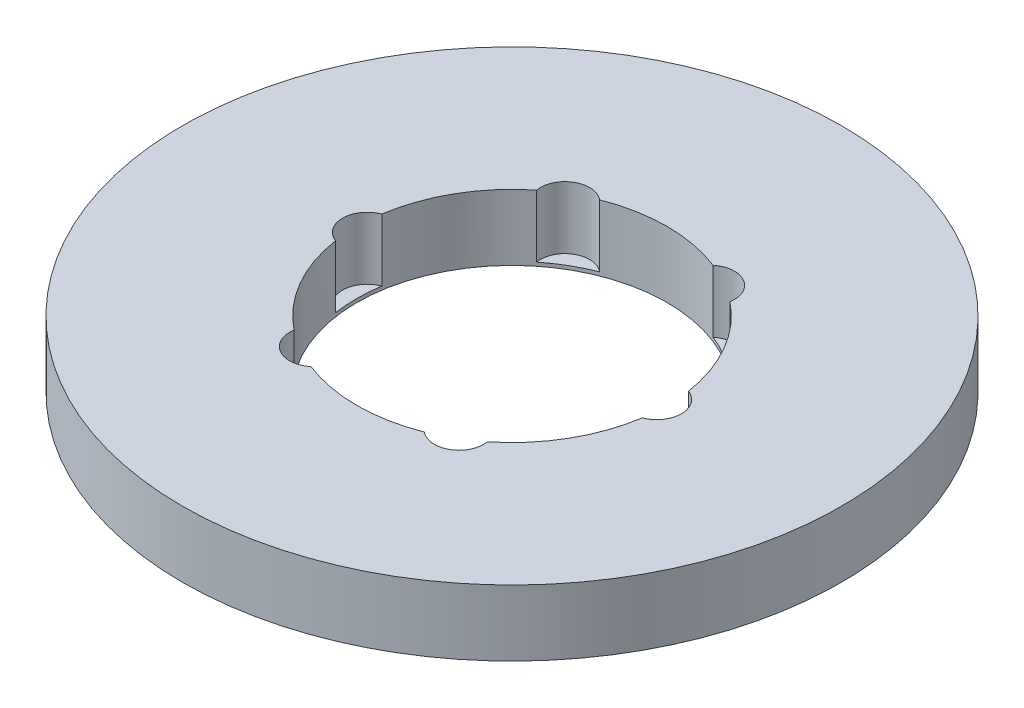
ISO-10303-21;
HEADER;
FILE_DESCRIPTION(('STEP AP214'),'2;1');
FILE_NAME('part.step','',(''),(''),'','','');
FILE_SCHEMA(('AUTOMOTIVE_DESIGN { 1 0 10303 214 1 1 1 1 }'));
ENDSEC;
DATA;
#1=APPLICATION_CONTEXT('core data for automotive mechanical design processes');
#2=APPLICATION_PROTOCOL_DEFINITION('international standard','automotive_design',2000,#1);
#3=PRODUCT_CONTEXT('',#1,'mechanical');
#4=PRODUCT('Part','Part','',(#3));
#5=PRODUCT_RELATED_PRODUCT_CATEGORY('part','',(#4));
#6=PRODUCT_DEFINITION_FORMATION('','',#4);
#7=PRODUCT_DEFINITION_CONTEXT('part definition',#1,'design');
#8=PRODUCT_DEFINITION('design','',#6,#7);
#9=PRODUCT_DEFINITION_SHAPE('','',#8);
#10=(LENGTH_UNIT() NAMED_UNIT(*) SI_UNIT(.MILLI.,.METRE.));
#11=(NAMED_UNIT(*) PLANE_ANGLE_UNIT() SI_UNIT($,.RADIAN.));
#12=(NAMED_UNIT(*) SI_UNIT($,.STERADIAN.) SOLID_ANGLE_UNIT());
#13=UNCERTAINTY_MEASURE_WITH_UNIT(LENGTH_MEASURE(1.E-05),#10,'distance_accuracy_value','');
#14=(GEOMETRIC_REPRESENTATION_CONTEXT(3) GLOBAL_UNCERTAINTY_ASSIGNED_CONTEXT((#13)) GLOBAL_UNIT_ASSIGNED_CONTEXT((#10,
#11,#12)) REPRESENTATION_CONTEXT('',''));
#15=CARTESIAN_POINT('',(0.,0.,0.));
#16=DIRECTION('',(0.,0.,1.));
#17=DIRECTION('',(1.,0.,0.));
#18=AXIS2_PLACEMENT_3D('',#15,#16,#17);
#19=CARTESIAN_POINT('',(0.,17.,0.));
#20=DIRECTION('',(0.,-1.,0.));
#21=DIRECTION('',(0.,0.,-1.));
#22=AXIS2_PLACEMENT_3D('',#19,#20,#21);
#23=CYLINDRICAL_SURFACE('',#22,85.);
#24=CARTESIAN_POINT('',(0.,17.,0.));
#25=DIRECTION('',(0.,1.,0.));
#26=DIRECTION('',(0.,0.,1.));
#27=AXIS2_PLACEMENT_3D('',#24,#25,#26);
#28=CIRCLE('',#27,85.);
#29=CARTESIAN_POINT('',(0.,17.,85.));
#30=VERTEX_POINT('',#29);
#31=EDGE_CURVE('E162',#30,#30,#28,.T.);
#32=ORIENTED_EDGE('',*,*,#31,.F.);
#33=EDGE_LOOP('',(#32));
#34=FACE_BOUND('',#33,.T.);
#35=CARTESIAN_POINT('',(0.,0.,0.));
#36=DIRECTION('',(0.,1.,0.));
#37=DIRECTION('',(0.,0.,1.));
#38=AXIS2_PLACEMENT_3D('',#35,#36,#37);
#39=CIRCLE('',#38,85.);
#40=CARTESIAN_POINT('',(0.,0.,85.));
#41=VERTEX_POINT('',#40);
#42=EDGE_CURVE('E157',#41,#41,#39,.T.);
#43=ORIENTED_EDGE('',*,*,#42,.T.);
#44=EDGE_LOOP('',(#43));
#45=FACE_BOUND('',#44,.T.);
#46=ADVANCED_FACE('F39',(#34,#45),#23,.T.);
#47=CARTESIAN_POINT('',(0.,17.,0.));
#48=DIRECTION('',(0.,1.,0.));
#49=DIRECTION('',(0.,0.,1.));
#50=AXIS2_PLACEMENT_3D('',#47,#48,#49);
#51=PLANE('',#50);
#52=CARTESIAN_POINT('',(-18.6743268406156,17.,-32.3448828850925));
#53=DIRECTION('',(0.,1.,0.));
#54=DIRECTION('',(-0.866025403784433,0.,0.50000000000001));
#55=AXIS2_PLACEMENT_3D('',#52,#53,#54);
#56=CIRCLE('',#55,6.35462968565896);
#57=CARTESIAN_POINT('',(-14.6153642567982,17.,-37.2342735613454));
#58=VERTEX_POINT('',#57);
#59=CARTESIAN_POINT('',(-24.938144667186,17.,-31.2744135126225));
#60=VERTEX_POINT('',#59);
#61=EDGE_CURVE('E218',#58,#60,#56,.T.);
#62=ORIENTED_EDGE('',*,*,#61,.F.);
#63=CARTESIAN_POINT('',(0.,17.,0.));
#64=DIRECTION('',(0.,1.,0.));
#65=DIRECTION('',(0.,0.,1.));
#66=AXIS2_PLACEMENT_3D('',#63,#64,#65);
#67=CIRCLE('',#66,40.);
#68=CARTESIAN_POINT('',(14.6153642567974,17.,-37.2342735613457));
#69=VERTEX_POINT('',#68);
#70=EDGE_CURVE('E169',#69,#58,#67,.T.);
#71=ORIENTED_EDGE('',*,*,#70,.F.);
#72=CARTESIAN_POINT('',(18.6743268406149,17.,-32.3448828850929));
#73=DIRECTION('',(0.,1.,0.));
#74=DIRECTION('',(-0.866025403784443,0.,-0.499999999999992));
#75=AXIS2_PLACEMENT_3D('',#72,#73,#74);
#76=CIRCLE('',#75,6.35462968565896);
#77=CARTESIAN_POINT('',(24.9381446671854,17.,-31.274413512623));
#78=VERTEX_POINT('',#77);
#79=EDGE_CURVE('E285',#78,#69,#76,.T.);
#80=ORIENTED_EDGE('',*,*,#79,.F.);
#81=CARTESIAN_POINT('',(39.5535089239834,17.,-5.95986004872282));
#82=VERTEX_POINT('',#81);
#83=EDGE_CURVE('E174',#82,#78,#67,.T.);
#84=ORIENTED_EDGE('',*,*,#83,.F.);
#85=CARTESIAN_POINT('',(37.3486536812304,17.,0.));
#86=DIRECTION('',(0.,1.,0.));
#87=DIRECTION('',(0.,0.,-1.));
#88=AXIS2_PLACEMENT_3D('',#85,#86,#87);
#89=CIRCLE('',#88,6.35462968565896);
#90=CARTESIAN_POINT('',(39.5535089239834,17.,5.95986004872282));
#91=VERTEX_POINT('',#90);
#92=EDGE_CURVE('E280',#91,#82,#89,.T.);
#93=ORIENTED_EDGE('',*,*,#92,.F.);
#94=CARTESIAN_POINT('',(24.9381446671858,17.,31.2744135126226));
#95=VERTEX_POINT('',#94);
#96=EDGE_CURVE('E164',#95,#91,#67,.T.);
#97=ORIENTED_EDGE('',*,*,#96,.F.);
#98=CARTESIAN_POINT('',(18.6743268406153,17.,32.3448828850926));
#99=DIRECTION('',(0.,1.,0.));
#100=DIRECTION('',(0.866025403784436,0.,-0.500000000000004));
#101=AXIS2_PLACEMENT_3D('',#98,#99,#100);
#102=CIRCLE('',#101,6.35462968565896);
#103=CARTESIAN_POINT('',(14.615364256798,17.,37.2342735613455));
#104=VERTEX_POINT('',#103);
#105=EDGE_CURVE('E269',#104,#95,#102,.T.);
#106=ORIENTED_EDGE('',*,*,#105,.F.);
#107=CARTESIAN_POINT('',(-14.6153642567977,17.,37.2342735613456));
#108=VERTEX_POINT('',#107);
#109=EDGE_CURVE('E149',#108,#104,#67,.T.);
#110=ORIENTED_EDGE('',*,*,#109,.F.);
#111=CARTESIAN_POINT('',(-18.6743268406151,17.,32.3448828850927));
#112=DIRECTION('',(0.,1.,0.));
#113=DIRECTION('',(0.86602540378444,0.,0.499999999999998));
#114=AXIS2_PLACEMENT_3D('',#111,#112,#113);
#115=CIRCLE('',#114,6.35462968565896);
#116=CARTESIAN_POINT('',(-24.9381446671856,17.,31.2744135126228));
#117=VERTEX_POINT('',#116);
#118=EDGE_CURVE('E128',#117,#108,#115,.T.);
#119=ORIENTED_EDGE('',*,*,#118,.F.);
#120=CARTESIAN_POINT('',(-39.5535089239834,17.,5.95986004872282));
#121=VERTEX_POINT('',#120);
#122=EDGE_CURVE('E148',#121,#117,#67,.T.);
#123=ORIENTED_EDGE('',*,*,#122,.F.);
#124=CARTESIAN_POINT('',(-37.3486536812304,17.,0.));
#125=DIRECTION('',(0.,1.,0.));
#126=DIRECTION('',(0.,0.,1.));
#127=AXIS2_PLACEMENT_3D('',#124,#125,#126);
#128=CIRCLE('',#127,6.35462968565896);
#129=CARTESIAN_POINT('',(-39.5535089239834,17.,-5.95986004872282));
#130=VERTEX_POINT('',#129);
#131=EDGE_CURVE('E179',#130,#121,#128,.T.);
#132=ORIENTED_EDGE('',*,*,#131,.F.);
#133=EDGE_CURVE('E161',#60,#130,#67,.T.);
#134=ORIENTED_EDGE('',*,*,#133,.F.);
#135=EDGE_LOOP('',(#62,#71,#80,#84,#93,#97,#106,#110,#119,#123,#132,#134));
#136=FACE_BOUND('',#135,.T.);
#137=ORIENTED_EDGE('',*,*,#31,.T.);
#138=EDGE_LOOP('',(#137));
#139=FACE_BOUND('',#138,.T.);
#140=ADVANCED_FACE('F141',(#136,#139),#51,.T.);
#141=CARTESIAN_POINT('',(0.,0.,0.));
#142=DIRECTION('',(0.,1.,0.));
#143=DIRECTION('',(0.,0.,1.));
#144=AXIS2_PLACEMENT_3D('',#141,#142,#143);
#145=PLANE('',#144);
#146=CARTESIAN_POINT('',(0.,0.,0.));
#147=DIRECTION('',(0.,1.,0.));
#148=DIRECTION('',(0.,0.,1.));
#149=AXIS2_PLACEMENT_3D('',#146,#147,#148);
#150=CIRCLE('',#149,40.);
#151=CARTESIAN_POINT('',(0.,0.,40.));
#152=VERTEX_POINT('',#151);
#153=EDGE_CURVE('E166',#152,#152,#150,.T.);
#154=ORIENTED_EDGE('',*,*,#153,.T.);
#155=EDGE_LOOP('',(#154));
#156=FACE_BOUND('',#155,.T.);
#157=ORIENTED_EDGE('',*,*,#42,.F.);
#158=EDGE_LOOP('',(#157));
#159=FACE_BOUND('',#158,.T.);
#160=ADVANCED_FACE('F234',(#156,#159),#145,.F.);
#161=CARTESIAN_POINT('',(0.,17.,0.));
#162=DIRECTION('',(0.,-1.,0.));
#163=DIRECTION('',(0.,0.,-1.));
#164=AXIS2_PLACEMENT_3D('',#161,#162,#163);
#165=CYLINDRICAL_SURFACE('',#164,40.);
#166=DIRECTION('',(0.,1.,0.));
#167=VECTOR('',#166,1.);
#168=CARTESIAN_POINT('',(-14.6153642567982,8.95978809434079,-37.2342735613454));
#169=LINE('',#168,#167);
#170=CARTESIAN_POINT('',(-14.6153642567982,0.919576188681576,-37.2342735613454));
#171=VERTEX_POINT('',#170);
#172=EDGE_CURVE('E11',#171,#58,#169,.T.);
#173=ORIENTED_EDGE('',*,*,#172,.F.);
#174=CARTESIAN_POINT('',(0.,0.919576188681576,0.));
#175=DIRECTION('',(0.,1.,0.));
#176=DIRECTION('',(0.,0.,1.));
#177=AXIS2_PLACEMENT_3D('',#174,#175,#176);
#178=CIRCLE('',#177,40.);
#179=CARTESIAN_POINT('',(-24.938144667186,0.919576188681576,-31.2744135126225));
#180=VERTEX_POINT('',#179);
#181=EDGE_CURVE('E214',#171,#180,#178,.T.);
#182=ORIENTED_EDGE('',*,*,#181,.T.);
#183=DIRECTION('',(0.,1.,0.));
#184=VECTOR('',#183,1.);
#185=CARTESIAN_POINT('',(-24.938144667186,8.95978809434079,-31.2744135126224));
#186=LINE('',#185,#184);
#187=EDGE_CURVE('E46',#60,#180,#186,.F.);
#188=ORIENTED_EDGE('',*,*,#187,.F.);
#189=ORIENTED_EDGE('',*,*,#133,.T.);
#190=DIRECTION('',(0.,1.,0.));
#191=VECTOR('',#190,1.);
#192=CARTESIAN_POINT('',(-39.5535089239834,8.95978809434079,-5.95986004872283));
#193=LINE('',#192,#191);
#194=CARTESIAN_POINT('',(-39.5535089239834,0.919576188681576,-5.95986004872282));
#195=VERTEX_POINT('',#194);
#196=EDGE_CURVE('E187',#195,#130,#193,.T.);
#197=ORIENTED_EDGE('',*,*,#196,.F.);
#198=CARTESIAN_POINT('',(0.,0.919576188681576,0.));
#199=DIRECTION('',(0.,1.,0.));
#200=DIRECTION('',(0.,0.,1.));
#201=AXIS2_PLACEMENT_3D('',#198,#199,#200);
#202=CIRCLE('',#201,40.);
#203=CARTESIAN_POINT('',(-39.5535089239834,0.919576188681576,5.95986004872282));
#204=VERTEX_POINT('',#203);
#205=EDGE_CURVE('E184',#195,#204,#202,.T.);
#206=ORIENTED_EDGE('',*,*,#205,.T.);
#207=DIRECTION('',(0.,1.,0.));
#208=VECTOR('',#207,1.);
#209=CARTESIAN_POINT('',(-39.5535089239834,8.95978809434079,5.95986004872283));
#210=LINE('',#209,#208);
#211=EDGE_CURVE('E158',#121,#204,#210,.F.);
#212=ORIENTED_EDGE('',*,*,#211,.F.);
#213=ORIENTED_EDGE('',*,*,#122,.T.);
#214=DIRECTION('',(0.,1.,0.));
#215=VECTOR('',#214,1.);
#216=CARTESIAN_POINT('',(-24.9381446671856,8.95978809434079,31.2744135126228));
#217=LINE('',#216,#215);
#218=CARTESIAN_POINT('',(-24.9381446671856,0.919576188681576,31.2744135126228));
#219=VERTEX_POINT('',#218);
#220=EDGE_CURVE('E127',#219,#117,#217,.T.);
#221=ORIENTED_EDGE('',*,*,#220,.F.);
#222=CARTESIAN_POINT('',(0.,0.919576188681576,0.));
#223=DIRECTION('',(0.,1.,0.));
#224=DIRECTION('',(0.,0.,1.));
#225=AXIS2_PLACEMENT_3D('',#222,#223,#224);
#226=CIRCLE('',#225,40.);
#227=CARTESIAN_POINT('',(-14.6153642567977,0.919576188681576,37.2342735613456));
#228=VERTEX_POINT('',#227);
#229=EDGE_CURVE('E189',#219,#228,#226,.T.);
#230=ORIENTED_EDGE('',*,*,#229,.T.);
#231=DIRECTION('',(0.,1.,0.));
#232=VECTOR('',#231,1.);
#233=CARTESIAN_POINT('',(-14.6153642567977,8.95978809434079,37.2342735613456));
#234=LINE('',#233,#232);
#235=EDGE_CURVE('E140',#108,#228,#234,.F.);
#236=ORIENTED_EDGE('',*,*,#235,.F.);
#237=ORIENTED_EDGE('',*,*,#109,.T.);
#238=DIRECTION('',(0.,1.,0.));
#239=VECTOR('',#238,1.);
#240=CARTESIAN_POINT('',(14.615364256798,8.95978809434079,37.2342735613455));
#241=LINE('',#240,#239);
#242=CARTESIAN_POINT('',(14.615364256798,0.919576188681576,37.2342735613455));
#243=VERTEX_POINT('',#242);
#244=EDGE_CURVE('E196',#243,#104,#241,.T.);
#245=ORIENTED_EDGE('',*,*,#244,.F.);
#246=CARTESIAN_POINT('',(0.,0.919576188681576,0.));
#247=DIRECTION('',(0.,1.,0.));
#248=DIRECTION('',(0.,0.,1.));
#249=AXIS2_PLACEMENT_3D('',#246,#247,#248);
#250=CIRCLE('',#249,40.);
#251=CARTESIAN_POINT('',(24.9381446671858,0.919576188681576,31.2744135126226));
#252=VERTEX_POINT('',#251);
#253=EDGE_CURVE('E136',#243,#252,#250,.T.);
#254=ORIENTED_EDGE('',*,*,#253,.T.);
#255=DIRECTION('',(0.,1.,0.));
#256=VECTOR('',#255,1.);
#257=CARTESIAN_POINT('',(24.9381446671858,8.95978809434079,31.2744135126226));
#258=LINE('',#257,#256);
#259=EDGE_CURVE('E194',#95,#252,#258,.F.);
#260=ORIENTED_EDGE('',*,*,#259,.F.);
#261=ORIENTED_EDGE('',*,*,#96,.T.);
#262=DIRECTION('',(0.,1.,0.));
#263=VECTOR('',#262,1.);
#264=CARTESIAN_POINT('',(39.5535089239834,8.95978809434079,5.95986004872283));
#265=LINE('',#264,#263);
#266=CARTESIAN_POINT('',(39.5535089239834,0.919576188681576,5.95986004872282));
#267=VERTEX_POINT('',#266);
#268=EDGE_CURVE('E206',#267,#91,#265,.T.);
#269=ORIENTED_EDGE('',*,*,#268,.F.);
#270=CARTESIAN_POINT('',(0.,0.919576188681576,0.));
#271=DIRECTION('',(0.,1.,0.));
#272=DIRECTION('',(0.,0.,1.));
#273=AXIS2_PLACEMENT_3D('',#270,#271,#272);
#274=CIRCLE('',#273,40.);
#275=CARTESIAN_POINT('',(39.5535089239834,0.919576188681576,-5.95986004872282));
#276=VERTEX_POINT('',#275);
#277=EDGE_CURVE('E199',#267,#276,#274,.T.);
#278=ORIENTED_EDGE('',*,*,#277,.T.);
#279=DIRECTION('',(0.,1.,0.));
#280=VECTOR('',#279,1.);
#281=CARTESIAN_POINT('',(39.5535089239834,8.95978809434079,-5.95986004872283));
#282=LINE('',#281,#280);
#283=EDGE_CURVE('E201',#82,#276,#282,.F.);
#284=ORIENTED_EDGE('',*,*,#283,.F.);
#285=ORIENTED_EDGE('',*,*,#83,.T.);
#286=DIRECTION('',(0.,1.,0.));
#287=VECTOR('',#286,1.);
#288=CARTESIAN_POINT('',(24.9381446671854,8.95978809434079,-31.274413512623));
#289=LINE('',#288,#287);
#290=CARTESIAN_POINT('',(24.9381446671854,0.919576188681576,-31.274413512623));
#291=VERTEX_POINT('',#290);
#292=EDGE_CURVE('E213',#291,#78,#289,.T.);
#293=ORIENTED_EDGE('',*,*,#292,.F.);
#294=CARTESIAN_POINT('',(0.,0.919576188681576,0.));
#295=DIRECTION('',(0.,1.,0.));
#296=DIRECTION('',(0.,0.,1.));
#297=AXIS2_PLACEMENT_3D('',#294,#295,#296);
#298=CIRCLE('',#297,40.);
#299=CARTESIAN_POINT('',(14.6153642567974,0.919576188681576,-37.2342735613457));
#300=VERTEX_POINT('',#299);
#301=EDGE_CURVE('E208',#291,#300,#298,.T.);
#302=ORIENTED_EDGE('',*,*,#301,.T.);
#303=DIRECTION('',(0.,1.,0.));
#304=VECTOR('',#303,1.);
#305=CARTESIAN_POINT('',(14.6153642567974,8.95978809434079,-37.2342735613457));
#306=LINE('',#305,#304);
#307=EDGE_CURVE('E211',#69,#300,#306,.F.);
#308=ORIENTED_EDGE('',*,*,#307,.F.);
#309=ORIENTED_EDGE('',*,*,#70,.T.);
#310=EDGE_LOOP('',(#173,#182,#188,#189,#197,#206,#212,#213,#221,#230,#236,#237,#245,#254,#260,
#261,#269,#278,#284,#285,#293,#302,#308,#309));
#311=FACE_BOUND('',#310,.T.);
#312=ORIENTED_EDGE('',*,*,#153,.F.);
#313=EDGE_LOOP('',(#312));
#314=FACE_BOUND('',#313,.T.);
#315=ADVANCED_FACE('F152',(#311,#314),#165,.F.);
#316=CARTESIAN_POINT('',(-37.3486536812304,0.919576188681576,0.));
#317=DIRECTION('',(0.,1.,0.));
#318=DIRECTION('',(0.,0.,1.));
#319=AXIS2_PLACEMENT_3D('',#316,#317,#318);
#320=CYLINDRICAL_SURFACE('',#319,6.35462968565896);
#321=ORIENTED_EDGE('',*,*,#196,.T.);
#322=ORIENTED_EDGE('',*,*,#131,.T.);
#323=ORIENTED_EDGE('',*,*,#211,.T.);
#324=CARTESIAN_POINT('',(-37.3486536812304,0.919576188681576,0.));
#325=DIRECTION('',(0.,1.,0.));
#326=DIRECTION('',(0.,0.,1.));
#327=AXIS2_PLACEMENT_3D('',#324,#325,#326);
#328=CIRCLE('',#327,6.35462968565896);
#329=EDGE_CURVE('E180',#195,#204,#328,.T.);
#330=ORIENTED_EDGE('',*,*,#329,.F.);
#331=EDGE_LOOP('',(#321,#322,#323,#330));
#332=FACE_BOUND('',#331,.T.);
#333=ADVANCED_FACE('F244',(#332),#320,.F.);
#334=CARTESIAN_POINT('',(-37.3486536812304,0.919576188681576,0.));
#335=DIRECTION('',(0.,1.,0.));
#336=DIRECTION('',(0.,0.,1.));
#337=AXIS2_PLACEMENT_3D('',#334,#335,#336);
#338=PLANE('',#337);
#339=ORIENTED_EDGE('',*,*,#329,.T.);
#340=ORIENTED_EDGE('',*,*,#205,.F.);
#341=EDGE_LOOP('',(#339,#340));
#342=FACE_BOUND('',#341,.T.);
#343=ADVANCED_FACE('F248',(#342),#338,.T.);
#344=CARTESIAN_POINT('',(-18.6743268406151,0.919576188681576,32.3448828850927));
#345=DIRECTION('',(0.,1.,0.));
#346=DIRECTION('',(0.,0.,1.));
#347=AXIS2_PLACEMENT_3D('',#344,#345,#346);
#348=CYLINDRICAL_SURFACE('',#347,6.35462968565896);
#349=ORIENTED_EDGE('',*,*,#220,.T.);
#350=ORIENTED_EDGE('',*,*,#118,.T.);
#351=ORIENTED_EDGE('',*,*,#235,.T.);
#352=CARTESIAN_POINT('',(-18.6743268406151,0.919576188681576,32.3448828850927));
#353=DIRECTION('',(0.,1.,0.));
#354=DIRECTION('',(0.86602540378444,0.,0.499999999999998));
#355=AXIS2_PLACEMENT_3D('',#352,#353,#354);
#356=CIRCLE('',#355,6.35462968565896);
#357=EDGE_CURVE('E135',#219,#228,#356,.T.);
#358=ORIENTED_EDGE('',*,*,#357,.F.);
#359=EDGE_LOOP('',(#349,#350,#351,#358));
#360=FACE_BOUND('',#359,.T.);
#361=ADVANCED_FACE('F126',(#360),#348,.F.);
#362=CARTESIAN_POINT('',(-18.6743268406151,0.919576188681576,32.3448828850927));
#363=DIRECTION('',(0.,1.,0.));
#364=DIRECTION('',(0.86602540378444,0.,0.499999999999998));
#365=AXIS2_PLACEMENT_3D('',#362,#363,#364);
#366=PLANE('',#365);
#367=ORIENTED_EDGE('',*,*,#357,.T.);
#368=ORIENTED_EDGE('',*,*,#229,.F.);
#369=EDGE_LOOP('',(#367,#368));
#370=FACE_BOUND('',#369,.T.);
#371=ADVANCED_FACE('F258',(#370),#366,.T.);
#372=CARTESIAN_POINT('',(18.6743268406153,0.919576188681576,32.3448828850926));
#373=DIRECTION('',(0.,1.,0.));
#374=DIRECTION('',(0.,0.,1.));
#375=AXIS2_PLACEMENT_3D('',#372,#373,#374);
#376=CYLINDRICAL_SURFACE('',#375,6.35462968565896);
#377=ORIENTED_EDGE('',*,*,#244,.T.);
#378=ORIENTED_EDGE('',*,*,#105,.T.);
#379=ORIENTED_EDGE('',*,*,#259,.T.);
#380=CARTESIAN_POINT('',(18.6743268406153,0.919576188681576,32.3448828850926));
#381=DIRECTION('',(0.,1.,0.));
#382=DIRECTION('',(0.866025403784436,0.,-0.500000000000004));
#383=AXIS2_PLACEMENT_3D('',#380,#381,#382);
#384=CIRCLE('',#383,6.35462968565896);
#385=EDGE_CURVE('E147',#243,#252,#384,.T.);
#386=ORIENTED_EDGE('',*,*,#385,.F.);
#387=EDGE_LOOP('',(#377,#378,#379,#386));
#388=FACE_BOUND('',#387,.T.);
#389=ADVANCED_FACE('F256',(#388),#376,.F.);
#390=CARTESIAN_POINT('',(18.6743268406153,0.919576188681576,32.3448828850926));
#391=DIRECTION('',(0.,1.,0.));
#392=DIRECTION('',(0.866025403784436,0.,-0.500000000000004));
#393=AXIS2_PLACEMENT_3D('',#390,#391,#392);
#394=PLANE('',#393);
#395=ORIENTED_EDGE('',*,*,#385,.T.);
#396=ORIENTED_EDGE('',*,*,#253,.F.);
#397=EDGE_LOOP('',(#395,#396));
#398=FACE_BOUND('',#397,.T.);
#399=ADVANCED_FACE('F263',(#398),#394,.T.);
#400=CARTESIAN_POINT('',(37.3486536812304,0.919576188681576,0.));
#401=DIRECTION('',(0.,1.,0.));
#402=DIRECTION('',(0.,0.,1.));
#403=AXIS2_PLACEMENT_3D('',#400,#401,#402);
#404=CYLINDRICAL_SURFACE('',#403,6.35462968565896);
#405=ORIENTED_EDGE('',*,*,#268,.T.);
#406=ORIENTED_EDGE('',*,*,#92,.T.);
#407=ORIENTED_EDGE('',*,*,#283,.T.);
#408=CARTESIAN_POINT('',(37.3486536812304,0.919576188681576,0.));
#409=DIRECTION('',(0.,1.,0.));
#410=DIRECTION('',(0.,0.,-1.));
#411=AXIS2_PLACEMENT_3D('',#408,#409,#410);
#412=CIRCLE('',#411,6.35462968565896);
#413=EDGE_CURVE('E273',#267,#276,#412,.T.);
#414=ORIENTED_EDGE('',*,*,#413,.F.);
#415=EDGE_LOOP('',(#405,#406,#407,#414));
#416=FACE_BOUND('',#415,.T.);
#417=ADVANCED_FACE('F297',(#416),#404,.F.);
#418=CARTESIAN_POINT('',(37.3486536812304,0.919576188681576,0.));
#419=DIRECTION('',(0.,1.,0.));
#420=DIRECTION('',(0.,0.,-1.));
#421=AXIS2_PLACEMENT_3D('',#418,#419,#420);
#422=PLANE('',#421);
#423=ORIENTED_EDGE('',*,*,#413,.T.);
#424=ORIENTED_EDGE('',*,*,#277,.F.);
#425=EDGE_LOOP('',(#423,#424));
#426=FACE_BOUND('',#425,.T.);
#427=ADVANCED_FACE('F299',(#426),#422,.T.);
#428=CARTESIAN_POINT('',(18.6743268406149,0.919576188681576,-32.3448828850929));
#429=DIRECTION('',(0.,1.,0.));
#430=DIRECTION('',(0.,0.,1.));
#431=AXIS2_PLACEMENT_3D('',#428,#429,#430);
#432=CYLINDRICAL_SURFACE('',#431,6.35462968565896);
#433=ORIENTED_EDGE('',*,*,#292,.T.);
#434=ORIENTED_EDGE('',*,*,#79,.T.);
#435=ORIENTED_EDGE('',*,*,#307,.T.);
#436=CARTESIAN_POINT('',(18.6743268406149,0.919576188681576,-32.3448828850929));
#437=DIRECTION('',(0.,1.,0.));
#438=DIRECTION('',(-0.866025403784443,0.,-0.499999999999992));
#439=AXIS2_PLACEMENT_3D('',#436,#437,#438);
#440=CIRCLE('',#439,6.35462968565896);
#441=EDGE_CURVE('E56',#291,#300,#440,.T.);
#442=ORIENTED_EDGE('',*,*,#441,.F.);
#443=EDGE_LOOP('',(#433,#434,#435,#442));
#444=FACE_BOUND('',#443,.T.);
#445=ADVANCED_FACE('F292',(#444),#432,.F.);
#446=CARTESIAN_POINT('',(18.6743268406149,0.919576188681576,-32.3448828850929));
#447=DIRECTION('',(0.,1.,0.));
#448=DIRECTION('',(-0.866025403784443,0.,-0.499999999999992));
#449=AXIS2_PLACEMENT_3D('',#446,#447,#448);
#450=PLANE('',#449);
#451=ORIENTED_EDGE('',*,*,#441,.T.);
#452=ORIENTED_EDGE('',*,*,#301,.F.);
#453=EDGE_LOOP('',(#451,#452));
#454=FACE_BOUND('',#453,.T.);
#455=ADVANCED_FACE('F226',(#454),#450,.T.);
#456=CARTESIAN_POINT('',(-18.6743268406156,0.919576188681576,-32.3448828850925));
#457=DIRECTION('',(0.,1.,0.));
#458=DIRECTION('',(0.,0.,1.));
#459=AXIS2_PLACEMENT_3D('',#456,#457,#458);
#460=CYLINDRICAL_SURFACE('',#459,6.35462968565896);
#461=ORIENTED_EDGE('',*,*,#172,.T.);
#462=ORIENTED_EDGE('',*,*,#61,.T.);
#463=ORIENTED_EDGE('',*,*,#187,.T.);
#464=CARTESIAN_POINT('',(-18.6743268406156,0.919576188681576,-32.3448828850925));
#465=DIRECTION('',(0.,1.,0.));
#466=DIRECTION('',(-0.866025403784433,0.,0.50000000000001));
#467=AXIS2_PLACEMENT_3D('',#464,#465,#466);
#468=CIRCLE('',#467,6.35462968565896);
#469=EDGE_CURVE('E55',#171,#180,#468,.T.);
#470=ORIENTED_EDGE('',*,*,#469,.F.);
#471=EDGE_LOOP('',(#461,#462,#463,#470));
#472=FACE_BOUND('',#471,.T.);
#473=ADVANCED_FACE('F217',(#472),#460,.F.);
#474=CARTESIAN_POINT('',(-18.6743268406156,0.919576188681576,-32.3448828850925));
#475=DIRECTION('',(0.,1.,0.));
#476=DIRECTION('',(-0.866025403784433,0.,0.50000000000001));
#477=AXIS2_PLACEMENT_3D('',#474,#475,#476);
#478=PLANE('',#477);
#479=ORIENTED_EDGE('',*,*,#469,.T.);
#480=ORIENTED_EDGE('',*,*,#181,.F.);
#481=EDGE_LOOP('',(#479,#480));
#482=FACE_BOUND('',#481,.T.);
#483=ADVANCED_FACE('F219',(#482),#478,.T.);
#484=CLOSED_SHELL('',(#46,#140,#160,#315,#333,#343,#361,#371,#389,#399,#417,#427,#445,#455,#473,#483));
#485=MANIFOLD_SOLID_BREP('B2',#484);
#486=ADVANCED_BREP_SHAPE_REPRESENTATION('',(#18,#485),#14);
#487=SHAPE_DEFINITION_REPRESENTATION(#9,#486);
ENDSEC;
END-ISO-10303-21;
